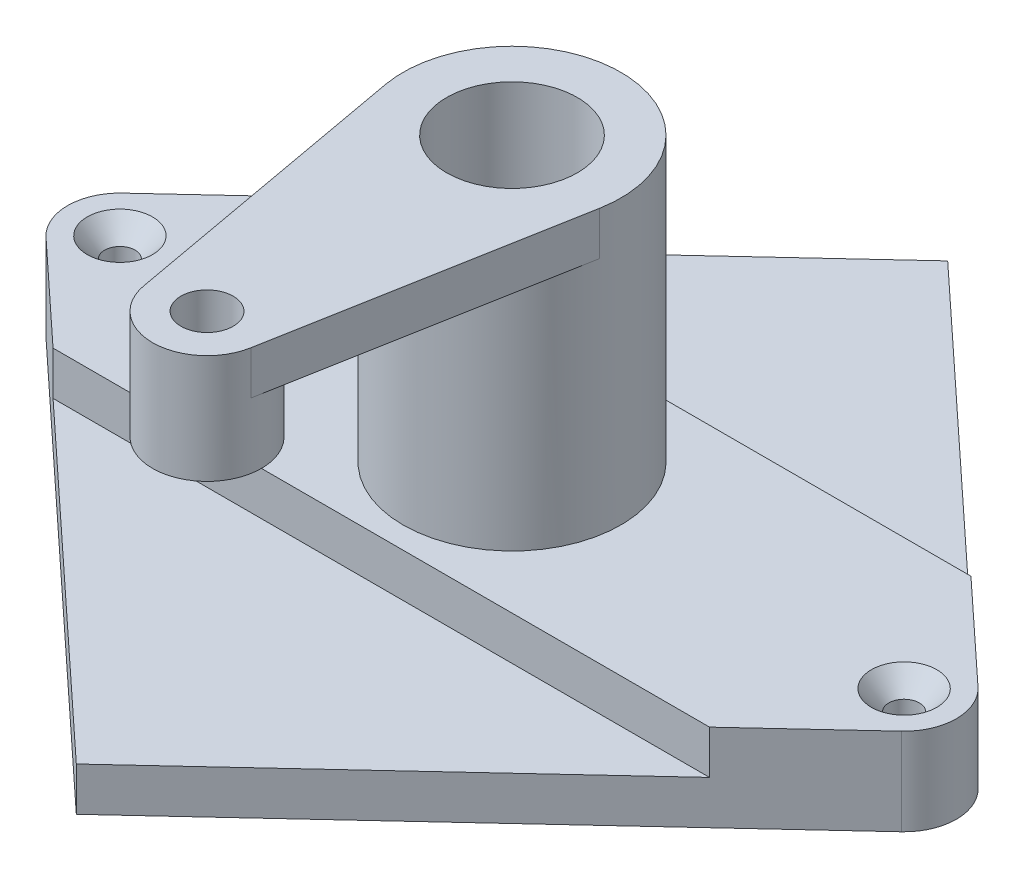
ISO-10303-21;
HEADER;
FILE_DESCRIPTION(('STEP AP214'),'2;1');
FILE_NAME('part.step','',(''),(''),'','','');
FILE_SCHEMA(('AUTOMOTIVE_DESIGN { 1 0 10303 214 1 1 1 1 }'));
ENDSEC;
DATA;
#1=APPLICATION_CONTEXT('core data for automotive mechanical design processes');
#2=APPLICATION_PROTOCOL_DEFINITION('international standard','automotive_design',2000,#1);
#3=PRODUCT_CONTEXT('',#1,'mechanical');
#4=PRODUCT('Part','Part','',(#3));
#5=PRODUCT_RELATED_PRODUCT_CATEGORY('part','',(#4));
#6=PRODUCT_DEFINITION_FORMATION('','',#4);
#7=PRODUCT_DEFINITION_CONTEXT('part definition',#1,'design');
#8=PRODUCT_DEFINITION('design','',#6,#7);
#9=PRODUCT_DEFINITION_SHAPE('','',#8);
#10=(LENGTH_UNIT() NAMED_UNIT(*) SI_UNIT(.MILLI.,.METRE.));
#11=(NAMED_UNIT(*) PLANE_ANGLE_UNIT() SI_UNIT($,.RADIAN.));
#12=(NAMED_UNIT(*) SI_UNIT($,.STERADIAN.) SOLID_ANGLE_UNIT());
#13=UNCERTAINTY_MEASURE_WITH_UNIT(LENGTH_MEASURE(1.E-05),#10,'distance_accuracy_value','');
#14=(GEOMETRIC_REPRESENTATION_CONTEXT(3) GLOBAL_UNCERTAINTY_ASSIGNED_CONTEXT((#13)) GLOBAL_UNIT_ASSIGNED_CONTEXT((#10,
#11,#12)) REPRESENTATION_CONTEXT('',''));
#15=CARTESIAN_POINT('',(0.,0.,0.));
#16=DIRECTION('',(0.,0.,1.));
#17=DIRECTION('',(1.,0.,0.));
#18=AXIS2_PLACEMENT_3D('',#15,#16,#17);
#19=CARTESIAN_POINT('',(0.,0.,0.));
#20=DIRECTION('',(0.,1.,0.));
#21=DIRECTION('',(0.,0.,1.));
#22=AXIS2_PLACEMENT_3D('',#19,#20,#21);
#23=PLANE('',#22);
#24=CARTESIAN_POINT('',(900.,0.,0.));
#25=DIRECTION('',(0.,1.,0.));
#26=DIRECTION('',(0.,0.,1.));
#27=AXIS2_PLACEMENT_3D('',#24,#25,#26);
#28=CIRCLE('',#27,74.999999987);
#29=CARTESIAN_POINT('',(900.,0.,74.999999987));
#30=VERTEX_POINT('',#29);
#31=EDGE_CURVE('E215',#30,#30,#28,.T.);
#32=ORIENTED_EDGE('',*,*,#31,.F.);
#33=EDGE_LOOP('',(#32));
#34=FACE_BOUND('',#33,.T.);
#35=CARTESIAN_POINT('',(-900.,0.,0.));
#36=DIRECTION('',(0.,1.,0.));
#37=DIRECTION('',(0.,0.,1.));
#38=AXIS2_PLACEMENT_3D('',#35,#36,#37);
#39=CIRCLE('',#38,74.999999987);
#40=CARTESIAN_POINT('',(-900.,0.,74.999999987));
#41=VERTEX_POINT('',#40);
#42=EDGE_CURVE('E235',#41,#41,#39,.T.);
#43=ORIENTED_EDGE('',*,*,#42,.F.);
#44=EDGE_LOOP('',(#43));
#45=FACE_BOUND('',#44,.T.);
#46=CARTESIAN_POINT('',(0.,0.,0.));
#47=DIRECTION('',(0.,1.,0.));
#48=DIRECTION('',(0.,0.,1.));
#49=AXIS2_PLACEMENT_3D('',#46,#47,#48);
#50=CIRCLE('',#49,250.);
#51=CARTESIAN_POINT('',(0.,0.,250.));
#52=VERTEX_POINT('',#51);
#53=EDGE_CURVE('E12',#52,#52,#50,.F.);
#54=ORIENTED_EDGE('',*,*,#53,.T.);
#55=EDGE_LOOP('',(#54));
#56=FACE_BOUND('',#55,.T.);
#57=DIRECTION('',(0.732596685082874,0.,0.680662983425414));
#58=VECTOR('',#57,1.);
#59=CARTESIAN_POINT('',(-498.651445316076,0.,536.697902994414));
#60=LINE('',#59,#58);
#61=CARTESIAN_POINT('',(-981.67955801105,0.,87.9116022099449));
#62=VERTEX_POINT('',#61);
#63=CARTESIAN_POINT('',(-753.409090909091,0.,300.));
#64=VERTEX_POINT('',#63);
#65=EDGE_CURVE('E362',#62,#64,#60,.T.);
#66=ORIENTED_EDGE('',*,*,#65,.T.);
#67=DIRECTION('',(1.,0.,0.));
#68=VECTOR('',#67,1.);
#69=CARTESIAN_POINT('',(0.,0.,300.));
#70=LINE('',#69,#68);
#71=CARTESIAN_POINT('',(753.409090909091,0.,300.));
#72=VERTEX_POINT('',#71);
#73=EDGE_CURVE('E294',#64,#72,#70,.T.);
#74=ORIENTED_EDGE('',*,*,#73,.T.);
#75=DIRECTION('',(0.732596685082873,0.,-0.680662983425414));
#76=VECTOR('',#75,1.);
#77=CARTESIAN_POINT('',(498.651445316077,0.,536.697902994414));
#78=LINE('',#77,#76);
#79=CARTESIAN_POINT('',(981.67955801105,0.,87.9116022099447));
#80=VERTEX_POINT('',#79);
#81=EDGE_CURVE('E366',#72,#80,#78,.T.);
#82=ORIENTED_EDGE('',*,*,#81,.T.);
#83=CARTESIAN_POINT('',(900.,0.,0.));
#84=DIRECTION('',(0.,1.,0.));
#85=DIRECTION('',(0.,0.,1.));
#86=AXIS2_PLACEMENT_3D('',#83,#84,#85);
#87=CIRCLE('',#86,120.);
#88=CARTESIAN_POINT('',(981.67955801105,0.,-87.9116022099444));
#89=VERTEX_POINT('',#88);
#90=EDGE_CURVE('E369',#80,#89,#87,.T.);
#91=ORIENTED_EDGE('',*,*,#90,.T.);
#92=DIRECTION('',(0.732596685082872,0.,0.680662983425415));
#93=VECTOR('',#92,1.);
#94=CARTESIAN_POINT('',(498.651445316078,0.,-536.697902994414));
#95=LINE('',#94,#93);
#96=CARTESIAN_POINT('',(753.409090909091,0.,-300.));
#97=VERTEX_POINT('',#96);
#98=EDGE_CURVE('E334',#97,#89,#95,.T.);
#99=ORIENTED_EDGE('',*,*,#98,.F.);
#100=DIRECTION('',(1.,0.,0.));
#101=VECTOR('',#100,1.);
#102=CARTESIAN_POINT('',(0.,0.,-300.));
#103=LINE('',#102,#101);
#104=CARTESIAN_POINT('',(-753.409090909091,0.,-300.));
#105=VERTEX_POINT('',#104);
#106=EDGE_CURVE('E280',#105,#97,#103,.T.);
#107=ORIENTED_EDGE('',*,*,#106,.F.);
#108=DIRECTION('',(0.732596685082873,0.,-0.680662983425414));
#109=VECTOR('',#108,1.);
#110=CARTESIAN_POINT('',(-498.651445316077,0.,-536.697902994414));
#111=LINE('',#110,#109);
#112=CARTESIAN_POINT('',(-981.67955801105,0.,-87.9116022099449));
#113=VERTEX_POINT('',#112);
#114=EDGE_CURVE('E353',#113,#105,#111,.T.);
#115=ORIENTED_EDGE('',*,*,#114,.F.);
#116=CARTESIAN_POINT('',(-900.,0.,0.));
#117=DIRECTION('',(0.,1.,0.));
#118=DIRECTION('',(0.,0.,1.));
#119=AXIS2_PLACEMENT_3D('',#116,#117,#118);
#120=CIRCLE('',#119,120.);
#121=EDGE_CURVE('E357',#113,#62,#120,.T.);
#122=ORIENTED_EDGE('',*,*,#121,.T.);
#123=EDGE_LOOP('',(#66,#74,#82,#91,#99,#107,#115,#122));
#124=FACE_BOUND('',#123,.T.);
#125=ADVANCED_FACE('F98',(#34,#45,#56,#124),#23,.T.);
#126=CARTESIAN_POINT('',(-498.651445316076,-200.,536.697902994414));
#127=DIRECTION('',(-0.680662983425414,0.,0.732596685082874));
#128=DIRECTION('',(0.732596685082874,0.,0.680662983425414));
#129=AXIS2_PLACEMENT_3D('',#126,#127,#128);
#130=PLANE('',#129);
#131=DIRECTION('',(0.732596685082873,0.,0.680662983425415));
#132=VECTOR('',#131,1.);
#133=CARTESIAN_POINT('',(-498.651445316077,-100.,536.697902994414));
#134=LINE('',#133,#132);
#135=CARTESIAN_POINT('',(-753.409090909091,-100.,300.));
#136=VERTEX_POINT('',#135);
#137=CARTESIAN_POINT('',(0.,-100.,1000.));
#138=VERTEX_POINT('',#137);
#139=EDGE_CURVE('E290',#136,#138,#134,.T.);
#140=ORIENTED_EDGE('',*,*,#139,.F.);
#141=DIRECTION('',(0.,1.,0.));
#142=VECTOR('',#141,1.);
#143=CARTESIAN_POINT('',(-753.409090909091,-100.,300.));
#144=LINE('',#143,#142);
#145=EDGE_CURVE('E306',#136,#64,#144,.T.);
#146=ORIENTED_EDGE('',*,*,#145,.T.);
#147=ORIENTED_EDGE('',*,*,#65,.F.);
#148=DIRECTION('',(0.,1.,0.));
#149=VECTOR('',#148,1.);
#150=CARTESIAN_POINT('',(-981.67955801105,-200.,87.9116022099449));
#151=LINE('',#150,#149);
#152=CARTESIAN_POINT('',(-981.67955801105,-200.,87.9116022099449));
#153=VERTEX_POINT('',#152);
#154=EDGE_CURVE('E383',#153,#62,#151,.T.);
#155=ORIENTED_EDGE('',*,*,#154,.F.);
#156=DIRECTION('',(0.732596685082874,0.,0.680662983425414));
#157=VECTOR('',#156,1.);
#158=CARTESIAN_POINT('',(-498.651445316076,-200.,536.697902994414));
#159=LINE('',#158,#157);
#160=CARTESIAN_POINT('',(0.,-200.,1000.));
#161=VERTEX_POINT('',#160);
#162=EDGE_CURVE('E338',#153,#161,#159,.T.);
#163=ORIENTED_EDGE('',*,*,#162,.T.);
#164=DIRECTION('',(0.,1.,0.));
#165=VECTOR('',#164,1.);
#166=CARTESIAN_POINT('',(0.,-200.,1000.));
#167=LINE('',#166,#165);
#168=EDGE_CURVE('E358',#161,#138,#167,.T.);
#169=ORIENTED_EDGE('',*,*,#168,.T.);
#170=EDGE_LOOP('',(#140,#146,#147,#155,#163,#169));
#171=FACE_BOUND('',#170,.T.);
#172=ADVANCED_FACE('F422',(#171),#130,.T.);
#173=CARTESIAN_POINT('',(498.651445316077,-200.,536.697902994414));
#174=DIRECTION('',(0.680662983425414,0.,0.732596685082873));
#175=DIRECTION('',(0.732596685082873,0.,-0.680662983425414));
#176=AXIS2_PLACEMENT_3D('',#173,#174,#175);
#177=PLANE('',#176);
#178=ORIENTED_EDGE('',*,*,#81,.F.);
#179=DIRECTION('',(0.,1.,0.));
#180=VECTOR('',#179,1.);
#181=CARTESIAN_POINT('',(753.409090909091,-100.,300.));
#182=LINE('',#181,#180);
#183=CARTESIAN_POINT('',(753.409090909091,-100.,300.));
#184=VERTEX_POINT('',#183);
#185=EDGE_CURVE('E301',#184,#72,#182,.T.);
#186=ORIENTED_EDGE('',*,*,#185,.F.);
#187=DIRECTION('',(0.732596685082873,0.,-0.680662983425415));
#188=VECTOR('',#187,1.);
#189=CARTESIAN_POINT('',(498.651445316077,-100.,536.697902994414));
#190=LINE('',#189,#188);
#191=EDGE_CURVE('E293',#138,#184,#190,.T.);
#192=ORIENTED_EDGE('',*,*,#191,.F.);
#193=ORIENTED_EDGE('',*,*,#168,.F.);
#194=DIRECTION('',(0.732596685082873,0.,-0.680662983425414));
#195=VECTOR('',#194,1.);
#196=CARTESIAN_POINT('',(498.651445316077,-200.,536.697902994414));
#197=LINE('',#196,#195);
#198=CARTESIAN_POINT('',(981.67955801105,-200.,87.9116022099447));
#199=VERTEX_POINT('',#198);
#200=EDGE_CURVE('E341',#161,#199,#197,.T.);
#201=ORIENTED_EDGE('',*,*,#200,.T.);
#202=DIRECTION('',(0.,1.,0.));
#203=VECTOR('',#202,1.);
#204=CARTESIAN_POINT('',(981.67955801105,-200.,87.9116022099447));
#205=LINE('',#204,#203);
#206=EDGE_CURVE('E379',#199,#80,#205,.T.);
#207=ORIENTED_EDGE('',*,*,#206,.T.);
#208=EDGE_LOOP('',(#178,#186,#192,#193,#201,#207));
#209=FACE_BOUND('',#208,.T.);
#210=ADVANCED_FACE('F428',(#209),#177,.T.);
#211=CARTESIAN_POINT('',(0.,-200.,0.));
#212=DIRECTION('',(0.,1.,0.));
#213=DIRECTION('',(0.,0.,1.));
#214=AXIS2_PLACEMENT_3D('',#211,#212,#213);
#215=CYLINDRICAL_SURFACE('',#214,250.);
#216=DIRECTION('',(0.,1.,0.));
#217=VECTOR('',#216,1.);
#218=CARTESIAN_POINT('',(-245.981737749213,550.,44.6428571428572));
#219=LINE('',#218,#217);
#220=CARTESIAN_POINT('',(-245.981737749213,550.,44.6428571428572));
#221=VERTEX_POINT('',#220);
#222=CARTESIAN_POINT('',(-245.981737749213,650.,44.6428571428572));
#223=VERTEX_POINT('',#222);
#224=EDGE_CURVE('E281',#221,#223,#219,.T.);
#225=ORIENTED_EDGE('',*,*,#224,.T.);
#226=CARTESIAN_POINT('',(0.,650.,0.));
#227=DIRECTION('',(0.,1.,0.));
#228=DIRECTION('',(0.,0.,1.));
#229=AXIS2_PLACEMENT_3D('',#226,#227,#228);
#230=CIRCLE('',#229,250.);
#231=CARTESIAN_POINT('',(245.981737749213,650.,44.6428571428572));
#232=VERTEX_POINT('',#231);
#233=EDGE_CURVE('E107',#232,#223,#230,.T.);
#234=ORIENTED_EDGE('',*,*,#233,.F.);
#235=DIRECTION('',(0.,1.,0.));
#236=VECTOR('',#235,1.);
#237=CARTESIAN_POINT('',(245.981737749213,550.,44.6428571428573));
#238=LINE('',#237,#236);
#239=CARTESIAN_POINT('',(245.981737749213,550.,44.6428571428573));
#240=VERTEX_POINT('',#239);
#241=EDGE_CURVE('E285',#240,#232,#238,.T.);
#242=ORIENTED_EDGE('',*,*,#241,.F.);
#243=CARTESIAN_POINT('',(0.,550.,0.));
#244=DIRECTION('',(0.,1.,0.));
#245=DIRECTION('',(0.,0.,1.));
#246=AXIS2_PLACEMENT_3D('',#243,#244,#245);
#247=CIRCLE('',#246,250.);
#248=EDGE_CURVE('E263',#221,#240,#247,.T.);
#249=ORIENTED_EDGE('',*,*,#248,.F.);
#250=EDGE_LOOP('',(#225,#234,#242,#249));
#251=FACE_BOUND('',#250,.T.);
#252=ORIENTED_EDGE('',*,*,#53,.F.);
#253=EDGE_LOOP('',(#252));
#254=FACE_BOUND('',#253,.T.);
#255=ADVANCED_FACE('F100',(#251,#254),#215,.T.);
#256=CARTESIAN_POINT('',(0.,650.,0.));
#257=DIRECTION('',(0.,1.,0.));
#258=DIRECTION('',(0.,0.,1.));
#259=AXIS2_PLACEMENT_3D('',#256,#257,#258);
#260=PLANE('',#259);
#261=CARTESIAN_POINT('',(0.,650.,700.));
#262=DIRECTION('',(0.,1.,0.));
#263=DIRECTION('',(0.,0.,1.));
#264=AXIS2_PLACEMENT_3D('',#261,#262,#263);
#265=CIRCLE('',#264,60.);
#266=CARTESIAN_POINT('',(0.,650.,760.));
#267=VERTEX_POINT('',#266);
#268=EDGE_CURVE('E805',#267,#267,#265,.T.);
#269=ORIENTED_EDGE('',*,*,#268,.F.);
#270=EDGE_LOOP('',(#269));
#271=FACE_BOUND('',#270,.T.);
#272=CARTESIAN_POINT('',(0.,650.,0.));
#273=DIRECTION('',(0.,1.,0.));
#274=DIRECTION('',(0.,0.,1.));
#275=AXIS2_PLACEMENT_3D('',#272,#273,#274);
#276=CIRCLE('',#275,149.999999974);
#277=CARTESIAN_POINT('',(0.,650.,149.999999974));
#278=VERTEX_POINT('',#277);
#279=EDGE_CURVE('E809',#278,#278,#276,.T.);
#280=ORIENTED_EDGE('',*,*,#279,.F.);
#281=EDGE_LOOP('',(#280));
#282=FACE_BOUND('',#281,.T.);
#283=ORIENTED_EDGE('',*,*,#233,.T.);
#284=DIRECTION('',(0.178571428571429,0.,0.983926950996851));
#285=VECTOR('',#284,1.);
#286=CARTESIAN_POINT('',(-245.981737749213,650.,44.6428571428571));
#287=LINE('',#286,#285);
#288=CARTESIAN_POINT('',(-122.990868874606,650.,722.321428571429));
#289=VERTEX_POINT('',#288);
#290=EDGE_CURVE('E259',#223,#289,#287,.T.);
#291=ORIENTED_EDGE('',*,*,#290,.T.);
#292=CARTESIAN_POINT('',(0.,650.,700.));
#293=DIRECTION('',(0.,1.,0.));
#294=DIRECTION('',(0.,0.,1.));
#295=AXIS2_PLACEMENT_3D('',#292,#293,#294);
#296=CIRCLE('',#295,125.);
#297=CARTESIAN_POINT('',(122.990868874606,650.,722.321428571429));
#298=VERTEX_POINT('',#297);
#299=EDGE_CURVE('E247',#289,#298,#296,.T.);
#300=ORIENTED_EDGE('',*,*,#299,.T.);
#301=DIRECTION('',(-0.178571428571429,0.,0.983926950996851));
#302=VECTOR('',#301,1.);
#303=CARTESIAN_POINT('',(245.981737749213,650.,44.6428571428572));
#304=LINE('',#303,#302);
#305=EDGE_CURVE('E114',#232,#298,#304,.T.);
#306=ORIENTED_EDGE('',*,*,#305,.F.);
#307=EDGE_LOOP('',(#283,#291,#300,#306));
#308=FACE_BOUND('',#307,.T.);
#309=ADVANCED_FACE('F395',(#271,#282,#308),#260,.T.);
#310=CARTESIAN_POINT('',(900.,-200.,0.));
#311=DIRECTION('',(0.,1.,0.));
#312=DIRECTION('',(0.,0.,1.));
#313=AXIS2_PLACEMENT_3D('',#310,#311,#312);
#314=CYLINDRICAL_SURFACE('',#313,120.);
#315=ORIENTED_EDGE('',*,*,#90,.F.);
#316=ORIENTED_EDGE('',*,*,#206,.F.);
#317=CARTESIAN_POINT('',(900.,-200.,0.));
#318=DIRECTION('',(0.,1.,0.));
#319=DIRECTION('',(0.,0.,1.));
#320=AXIS2_PLACEMENT_3D('',#317,#318,#319);
#321=CIRCLE('',#320,120.);
#322=CARTESIAN_POINT('',(981.67955801105,-200.,-87.9116022099444));
#323=VERTEX_POINT('',#322);
#324=EDGE_CURVE('E345',#199,#323,#321,.T.);
#325=ORIENTED_EDGE('',*,*,#324,.T.);
#326=DIRECTION('',(0.,1.,0.));
#327=VECTOR('',#326,1.);
#328=CARTESIAN_POINT('',(981.67955801105,-200.,-87.9116022099444));
#329=LINE('',#328,#327);
#330=EDGE_CURVE('E375',#323,#89,#329,.T.);
#331=ORIENTED_EDGE('',*,*,#330,.T.);
#332=EDGE_LOOP('',(#315,#316,#325,#331));
#333=FACE_BOUND('',#332,.T.);
#334=ADVANCED_FACE('F441',(#333),#314,.T.);
#335=CARTESIAN_POINT('',(498.651445316078,-200.,-536.697902994414));
#336=DIRECTION('',(-0.680662983425415,0.,0.732596685082872));
#337=DIRECTION('',(0.732596685082872,0.,0.680662983425415));
#338=AXIS2_PLACEMENT_3D('',#335,#336,#337);
#339=PLANE('',#338);
#340=DIRECTION('',(-0.732596685082873,0.,-0.680662983425414));
#341=VECTOR('',#340,1.);
#342=CARTESIAN_POINT('',(498.651445316077,-100.,-536.697902994414));
#343=LINE('',#342,#341);
#344=CARTESIAN_POINT('',(753.409090909091,-100.,-300.));
#345=VERTEX_POINT('',#344);
#346=CARTESIAN_POINT('',(0.,-100.,-1000.));
#347=VERTEX_POINT('',#346);
#348=EDGE_CURVE('E122',#345,#347,#343,.T.);
#349=ORIENTED_EDGE('',*,*,#348,.F.);
#350=DIRECTION('',(0.,1.,0.));
#351=VECTOR('',#350,1.);
#352=CARTESIAN_POINT('',(753.409090909091,-100.,-300.));
#353=LINE('',#352,#351);
#354=EDGE_CURVE('E305',#345,#97,#353,.T.);
#355=ORIENTED_EDGE('',*,*,#354,.T.);
#356=ORIENTED_EDGE('',*,*,#98,.T.);
#357=ORIENTED_EDGE('',*,*,#330,.F.);
#358=DIRECTION('',(0.732596685082872,0.,0.680662983425415));
#359=VECTOR('',#358,1.);
#360=CARTESIAN_POINT('',(498.651445316078,-200.,-536.697902994414));
#361=LINE('',#360,#359);
#362=CARTESIAN_POINT('',(0.,-200.,-1000.));
#363=VERTEX_POINT('',#362);
#364=EDGE_CURVE('E349',#363,#323,#361,.T.);
#365=ORIENTED_EDGE('',*,*,#364,.F.);
#366=DIRECTION('',(0.,1.,0.));
#367=VECTOR('',#366,1.);
#368=CARTESIAN_POINT('',(0.,-200.,-1000.));
#369=LINE('',#368,#367);
#370=EDGE_CURVE('E310',#363,#347,#369,.T.);
#371=ORIENTED_EDGE('',*,*,#370,.T.);
#372=EDGE_LOOP('',(#349,#355,#356,#357,#365,#371));
#373=FACE_BOUND('',#372,.T.);
#374=ADVANCED_FACE('F437',(#373),#339,.F.);
#375=CARTESIAN_POINT('',(-498.651445316077,-200.,-536.697902994414));
#376=DIRECTION('',(0.680662983425414,0.,0.732596685082873));
#377=DIRECTION('',(0.732596685082873,0.,-0.680662983425414));
#378=AXIS2_PLACEMENT_3D('',#375,#376,#377);
#379=PLANE('',#378);
#380=ORIENTED_EDGE('',*,*,#114,.T.);
#381=DIRECTION('',(0.,1.,0.));
#382=VECTOR('',#381,1.);
#383=CARTESIAN_POINT('',(-753.409090909091,-100.,-300.));
#384=LINE('',#383,#382);
#385=CARTESIAN_POINT('',(-753.409090909091,-100.,-300.));
#386=VERTEX_POINT('',#385);
#387=EDGE_CURVE('E321',#386,#105,#384,.T.);
#388=ORIENTED_EDGE('',*,*,#387,.F.);
#389=DIRECTION('',(-0.732596685082873,0.,0.680662983425415));
#390=VECTOR('',#389,1.);
#391=CARTESIAN_POINT('',(-498.651445316077,-100.,-536.697902994414));
#392=LINE('',#391,#390);
#393=EDGE_CURVE('E315',#347,#386,#392,.T.);
#394=ORIENTED_EDGE('',*,*,#393,.F.);
#395=ORIENTED_EDGE('',*,*,#370,.F.);
#396=DIRECTION('',(0.732596685082873,0.,-0.680662983425414));
#397=VECTOR('',#396,1.);
#398=CARTESIAN_POINT('',(-498.651445316077,-200.,-536.697902994414));
#399=LINE('',#398,#397);
#400=CARTESIAN_POINT('',(-981.67955801105,-200.,-87.9116022099449));
#401=VERTEX_POINT('',#400);
#402=EDGE_CURVE('E329',#401,#363,#399,.T.);
#403=ORIENTED_EDGE('',*,*,#402,.F.);
#404=DIRECTION('',(0.,1.,0.));
#405=VECTOR('',#404,1.);
#406=CARTESIAN_POINT('',(-981.67955801105,-200.,-87.9116022099449));
#407=LINE('',#406,#405);
#408=EDGE_CURVE('E352',#401,#113,#407,.T.);
#409=ORIENTED_EDGE('',*,*,#408,.T.);
#410=EDGE_LOOP('',(#380,#388,#394,#395,#403,#409));
#411=FACE_BOUND('',#410,.T.);
#412=ADVANCED_FACE('F440',(#411),#379,.F.);
#413=CARTESIAN_POINT('',(-900.,-200.,0.));
#414=DIRECTION('',(0.,1.,0.));
#415=DIRECTION('',(0.,0.,1.));
#416=AXIS2_PLACEMENT_3D('',#413,#414,#415);
#417=CYLINDRICAL_SURFACE('',#416,120.);
#418=ORIENTED_EDGE('',*,*,#121,.F.);
#419=ORIENTED_EDGE('',*,*,#408,.F.);
#420=CARTESIAN_POINT('',(-900.,-200.,0.));
#421=DIRECTION('',(0.,1.,0.));
#422=DIRECTION('',(0.,0.,1.));
#423=AXIS2_PLACEMENT_3D('',#420,#421,#422);
#424=CIRCLE('',#423,120.);
#425=EDGE_CURVE('E333',#401,#153,#424,.T.);
#426=ORIENTED_EDGE('',*,*,#425,.T.);
#427=ORIENTED_EDGE('',*,*,#154,.T.);
#428=EDGE_LOOP('',(#418,#419,#426,#427));
#429=FACE_BOUND('',#428,.T.);
#430=ADVANCED_FACE('F449',(#429),#417,.T.);
#431=CARTESIAN_POINT('',(0.,-200.,0.));
#432=DIRECTION('',(0.,1.,0.));
#433=DIRECTION('',(0.,0.,1.));
#434=AXIS2_PLACEMENT_3D('',#431,#432,#433);
#435=PLANE('',#434);
#436=CARTESIAN_POINT('',(900.,-200.,0.));
#437=DIRECTION('',(0.,1.,0.));
#438=DIRECTION('',(0.,0.,1.));
#439=AXIS2_PLACEMENT_3D('',#436,#437,#438);
#440=CIRCLE('',#439,34.9999999769999);
#441=CARTESIAN_POINT('',(900.,-200.,34.9999999769999));
#442=VERTEX_POINT('',#441);
#443=EDGE_CURVE('E231',#442,#442,#440,.T.);
#444=ORIENTED_EDGE('',*,*,#443,.T.);
#445=EDGE_LOOP('',(#444));
#446=FACE_BOUND('',#445,.T.);
#447=CARTESIAN_POINT('',(-900.,-200.,0.));
#448=DIRECTION('',(0.,1.,0.));
#449=DIRECTION('',(0.,0.,1.));
#450=AXIS2_PLACEMENT_3D('',#447,#448,#449);
#451=CIRCLE('',#450,34.9999999769999);
#452=CARTESIAN_POINT('',(-900.,-200.,34.9999999769999));
#453=VERTEX_POINT('',#452);
#454=EDGE_CURVE('E243',#453,#453,#451,.T.);
#455=ORIENTED_EDGE('',*,*,#454,.T.);
#456=EDGE_LOOP('',(#455));
#457=FACE_BOUND('',#456,.T.);
#458=ORIENTED_EDGE('',*,*,#402,.T.);
#459=ORIENTED_EDGE('',*,*,#364,.T.);
#460=ORIENTED_EDGE('',*,*,#324,.F.);
#461=ORIENTED_EDGE('',*,*,#200,.F.);
#462=ORIENTED_EDGE('',*,*,#162,.F.);
#463=ORIENTED_EDGE('',*,*,#425,.F.);
#464=EDGE_LOOP('',(#458,#459,#460,#461,#462,#463));
#465=FACE_BOUND('',#464,.T.);
#466=ADVANCED_FACE('F452',(#446,#457,#465),#435,.F.);
#467=CARTESIAN_POINT('',(0.,-100.,300.));
#468=DIRECTION('',(0.,0.,1.));
#469=DIRECTION('',(1.,0.,0.));
#470=AXIS2_PLACEMENT_3D('',#467,#468,#469);
#471=PLANE('',#470);
#472=ORIENTED_EDGE('',*,*,#73,.F.);
#473=ORIENTED_EDGE('',*,*,#145,.F.);
#474=DIRECTION('',(1.,0.,0.));
#475=VECTOR('',#474,1.);
#476=CARTESIAN_POINT('',(0.,-100.,300.));
#477=LINE('',#476,#475);
#478=EDGE_CURVE('E298',#136,#184,#477,.T.);
#479=ORIENTED_EDGE('',*,*,#478,.T.);
#480=ORIENTED_EDGE('',*,*,#185,.T.);
#481=EDGE_LOOP('',(#472,#473,#479,#480));
#482=FACE_BOUND('',#481,.T.);
#483=ADVANCED_FACE('F460',(#482),#471,.T.);
#484=CARTESIAN_POINT('',(0.,-100.,0.));
#485=DIRECTION('',(0.,1.,0.));
#486=DIRECTION('',(0.,0.,1.));
#487=AXIS2_PLACEMENT_3D('',#484,#485,#486);
#488=PLANE('',#487);
#489=ORIENTED_EDGE('',*,*,#139,.T.);
#490=ORIENTED_EDGE('',*,*,#191,.T.);
#491=ORIENTED_EDGE('',*,*,#478,.F.);
#492=EDGE_LOOP('',(#489,#490,#491));
#493=FACE_BOUND('',#492,.T.);
#494=ADVANCED_FACE('F465',(#493),#488,.T.);
#495=CARTESIAN_POINT('',(0.,-100.,-300.));
#496=DIRECTION('',(0.,0.,1.));
#497=DIRECTION('',(1.,0.,0.));
#498=AXIS2_PLACEMENT_3D('',#495,#496,#497);
#499=PLANE('',#498);
#500=ORIENTED_EDGE('',*,*,#106,.T.);
#501=ORIENTED_EDGE('',*,*,#354,.F.);
#502=DIRECTION('',(1.,0.,0.));
#503=VECTOR('',#502,1.);
#504=CARTESIAN_POINT('',(0.,-100.,-300.));
#505=LINE('',#504,#503);
#506=EDGE_CURVE('E318',#386,#345,#505,.T.);
#507=ORIENTED_EDGE('',*,*,#506,.F.);
#508=ORIENTED_EDGE('',*,*,#387,.T.);
#509=EDGE_LOOP('',(#500,#501,#507,#508));
#510=FACE_BOUND('',#509,.T.);
#511=ADVANCED_FACE('F435',(#510),#499,.F.);
#512=CARTESIAN_POINT('',(0.,-100.,0.));
#513=DIRECTION('',(0.,1.,0.));
#514=DIRECTION('',(0.,0.,1.));
#515=AXIS2_PLACEMENT_3D('',#512,#513,#514);
#516=PLANE('',#515);
#517=ORIENTED_EDGE('',*,*,#348,.T.);
#518=ORIENTED_EDGE('',*,*,#393,.T.);
#519=ORIENTED_EDGE('',*,*,#506,.T.);
#520=EDGE_LOOP('',(#517,#518,#519));
#521=FACE_BOUND('',#520,.T.);
#522=ADVANCED_FACE('F418',(#521),#516,.T.);
#523=CARTESIAN_POINT('',(-245.981737749213,550.,44.6428571428571));
#524=DIRECTION('',(-0.983926950996851,0.,0.178571428571429));
#525=DIRECTION('',(0.178571428571429,0.,0.983926950996851));
#526=AXIS2_PLACEMENT_3D('',#523,#524,#525);
#527=PLANE('',#526);
#528=ORIENTED_EDGE('',*,*,#290,.F.);
#529=ORIENTED_EDGE('',*,*,#224,.F.);
#530=DIRECTION('',(0.178571428571429,0.,0.983926950996851));
#531=VECTOR('',#530,1.);
#532=CARTESIAN_POINT('',(-245.981737749213,550.,44.6428571428571));
#533=LINE('',#532,#531);
#534=CARTESIAN_POINT('',(-122.990868874606,550.,722.321428571429));
#535=VERTEX_POINT('',#534);
#536=EDGE_CURVE('E266',#221,#535,#533,.T.);
#537=ORIENTED_EDGE('',*,*,#536,.T.);
#538=DIRECTION('',(0.,1.,0.));
#539=VECTOR('',#538,1.);
#540=CARTESIAN_POINT('',(-122.990868874606,550.,722.321428571429));
#541=LINE('',#540,#539);
#542=EDGE_CURVE('E276',#535,#289,#541,.T.);
#543=ORIENTED_EDGE('',*,*,#542,.T.);
#544=EDGE_LOOP('',(#528,#529,#537,#543));
#545=FACE_BOUND('',#544,.T.);
#546=ADVANCED_FACE('F402',(#545),#527,.T.);
#547=CARTESIAN_POINT('',(245.981737749213,550.,44.6428571428572));
#548=DIRECTION('',(-0.983926950996851,0.,-0.178571428571429));
#549=DIRECTION('',(-0.178571428571429,0.,0.983926950996851));
#550=AXIS2_PLACEMENT_3D('',#547,#548,#549);
#551=PLANE('',#550);
#552=ORIENTED_EDGE('',*,*,#305,.T.);
#553=DIRECTION('',(0.,1.,0.));
#554=VECTOR('',#553,1.);
#555=CARTESIAN_POINT('',(122.990868874606,550.,722.321428571429));
#556=LINE('',#555,#554);
#557=CARTESIAN_POINT('',(122.990868874606,550.,722.321428571429));
#558=VERTEX_POINT('',#557);
#559=EDGE_CURVE('E270',#558,#298,#556,.T.);
#560=ORIENTED_EDGE('',*,*,#559,.F.);
#561=DIRECTION('',(-0.178571428571429,0.,0.983926950996851));
#562=VECTOR('',#561,1.);
#563=CARTESIAN_POINT('',(245.981737749213,550.,44.6428571428572));
#564=LINE('',#563,#562);
#565=EDGE_CURVE('E258',#240,#558,#564,.T.);
#566=ORIENTED_EDGE('',*,*,#565,.F.);
#567=ORIENTED_EDGE('',*,*,#241,.T.);
#568=EDGE_LOOP('',(#552,#560,#566,#567));
#569=FACE_BOUND('',#568,.T.);
#570=ADVANCED_FACE('F410',(#569),#551,.F.);
#571=CARTESIAN_POINT('',(0.,550.,0.));
#572=DIRECTION('',(0.,1.,0.));
#573=DIRECTION('',(0.,0.,1.));
#574=AXIS2_PLACEMENT_3D('',#571,#572,#573);
#575=PLANE('',#574);
#576=CARTESIAN_POINT('',(0.,550.,700.));
#577=DIRECTION('',(0.,1.,0.));
#578=DIRECTION('',(0.,0.,1.));
#579=AXIS2_PLACEMENT_3D('',#576,#577,#578);
#580=CIRCLE('',#579,125.);
#581=EDGE_CURVE('E254',#558,#535,#580,.T.);
#582=ORIENTED_EDGE('',*,*,#581,.T.);
#583=ORIENTED_EDGE('',*,*,#536,.F.);
#584=ORIENTED_EDGE('',*,*,#248,.T.);
#585=ORIENTED_EDGE('',*,*,#565,.T.);
#586=EDGE_LOOP('',(#582,#583,#584,#585));
#587=FACE_BOUND('',#586,.T.);
#588=ADVANCED_FACE('F404',(#587),#575,.F.);
#589=CARTESIAN_POINT('',(0.,400.,700.));
#590=DIRECTION('',(0.,1.,0.));
#591=DIRECTION('',(0.,0.,1.));
#592=AXIS2_PLACEMENT_3D('',#589,#590,#591);
#593=CYLINDRICAL_SURFACE('',#592,125.);
#594=CARTESIAN_POINT('',(0.,400.,700.));
#595=DIRECTION('',(0.,1.,0.));
#596=DIRECTION('',(0.,0.,1.));
#597=AXIS2_PLACEMENT_3D('',#594,#595,#596);
#598=CIRCLE('',#597,125.);
#599=CARTESIAN_POINT('',(0.,400.,825.));
#600=VERTEX_POINT('',#599);
#601=EDGE_CURVE('E248',#600,#600,#598,.T.);
#602=ORIENTED_EDGE('',*,*,#601,.T.);
#603=EDGE_LOOP('',(#602));
#604=FACE_BOUND('',#603,.T.);
#605=ORIENTED_EDGE('',*,*,#542,.F.);
#606=ORIENTED_EDGE('',*,*,#581,.F.);
#607=ORIENTED_EDGE('',*,*,#559,.T.);
#608=ORIENTED_EDGE('',*,*,#299,.F.);
#609=EDGE_LOOP('',(#605,#606,#607,#608));
#610=FACE_BOUND('',#609,.T.);
#611=ADVANCED_FACE('F408',(#604,#610),#593,.T.);
#612=CARTESIAN_POINT('',(0.,400.,0.));
#613=DIRECTION('',(0.,1.,0.));
#614=DIRECTION('',(0.,0.,1.));
#615=AXIS2_PLACEMENT_3D('',#612,#613,#614);
#616=PLANE('',#615);
#617=CARTESIAN_POINT('',(0.,400.,700.));
#618=DIRECTION('',(0.,1.,0.));
#619=DIRECTION('',(0.,0.,1.));
#620=AXIS2_PLACEMENT_3D('',#617,#618,#619);
#621=CIRCLE('',#620,60.);
#622=CARTESIAN_POINT('',(0.,400.,760.));
#623=VERTEX_POINT('',#622);
#624=EDGE_CURVE('E802',#623,#623,#621,.T.);
#625=ORIENTED_EDGE('',*,*,#624,.T.);
#626=EDGE_LOOP('',(#625));
#627=FACE_BOUND('',#626,.T.);
#628=ORIENTED_EDGE('',*,*,#601,.F.);
#629=EDGE_LOOP('',(#628));
#630=FACE_BOUND('',#629,.T.);
#631=ADVANCED_FACE('F554',(#627,#630),#616,.F.);
#632=CARTESIAN_POINT('',(-900.,0.,0.));
#633=DIRECTION('',(0.,1.,0.));
#634=DIRECTION('',(0.,0.,1.));
#635=AXIS2_PLACEMENT_3D('',#632,#633,#634);
#636=CYLINDRICAL_SURFACE('',#635,34.9999999769999);
#637=ORIENTED_EDGE('',*,*,#454,.F.);
#638=EDGE_LOOP('',(#637));
#639=FACE_BOUND('',#638,.T.);
#640=CARTESIAN_POINT('',(-900.,-46.0147363003441,0.));
#641=DIRECTION('',(0.,1.,0.));
#642=DIRECTION('',(0.,0.,1.));
#643=AXIS2_PLACEMENT_3D('',#640,#641,#642);
#644=CIRCLE('',#643,34.9999999769999);
#645=CARTESIAN_POINT('',(-900.,-46.0147363003441,34.9999999769999));
#646=VERTEX_POINT('',#645);
#647=EDGE_CURVE('E239',#646,#646,#644,.T.);
#648=ORIENTED_EDGE('',*,*,#647,.T.);
#649=EDGE_LOOP('',(#648));
#650=FACE_BOUND('',#649,.T.);
#651=ADVANCED_FACE('F576',(#639,#650),#636,.F.);
#652=CARTESIAN_POINT('',(-900.,0.,0.));
#653=DIRECTION('',(0.,1.,0.));
#654=DIRECTION('',(0.,0.,1.));
#655=AXIS2_PLACEMENT_3D('',#652,#653,#654);
#656=CONICAL_SURFACE('',#655,74.999999987,0.715584993317676);
#657=ORIENTED_EDGE('',*,*,#647,.F.);
#658=EDGE_LOOP('',(#657));
#659=FACE_BOUND('',#658,.T.);
#660=ORIENTED_EDGE('',*,*,#42,.T.);
#661=EDGE_LOOP('',(#660));
#662=FACE_BOUND('',#661,.T.);
#663=ADVANCED_FACE('F581',(#659,#662),#656,.F.);
#664=CARTESIAN_POINT('',(900.,0.,0.));
#665=DIRECTION('',(0.,1.,0.));
#666=DIRECTION('',(0.,0.,1.));
#667=AXIS2_PLACEMENT_3D('',#664,#665,#666);
#668=CYLINDRICAL_SURFACE('',#667,34.9999999769999);
#669=ORIENTED_EDGE('',*,*,#443,.F.);
#670=EDGE_LOOP('',(#669));
#671=FACE_BOUND('',#670,.T.);
#672=CARTESIAN_POINT('',(900.,-46.0147363003441,0.));
#673=DIRECTION('',(0.,1.,0.));
#674=DIRECTION('',(0.,0.,1.));
#675=AXIS2_PLACEMENT_3D('',#672,#673,#674);
#676=CIRCLE('',#675,34.9999999769999);
#677=CARTESIAN_POINT('',(900.,-46.0147363003441,34.9999999769999));
#678=VERTEX_POINT('',#677);
#679=EDGE_CURVE('E221',#678,#678,#676,.T.);
#680=ORIENTED_EDGE('',*,*,#679,.T.);
#681=EDGE_LOOP('',(#680));
#682=FACE_BOUND('',#681,.T.);
#683=ADVANCED_FACE('F592',(#671,#682),#668,.F.);
#684=CARTESIAN_POINT('',(900.,0.,0.));
#685=DIRECTION('',(0.,1.,0.));
#686=DIRECTION('',(0.,0.,1.));
#687=AXIS2_PLACEMENT_3D('',#684,#685,#686);
#688=CONICAL_SURFACE('',#687,74.999999987,0.715584993317676);
#689=ORIENTED_EDGE('',*,*,#679,.F.);
#690=EDGE_LOOP('',(#689));
#691=FACE_BOUND('',#690,.T.);
#692=ORIENTED_EDGE('',*,*,#31,.T.);
#693=EDGE_LOOP('',(#692));
#694=FACE_BOUND('',#693,.T.);
#695=ADVANCED_FACE('F208',(#691,#694),#688,.F.);
#696=CARTESIAN_POINT('',(0.,224.034424767111,0.));
#697=DIRECTION('',(0.,1.,0.));
#698=DIRECTION('',(0.,0.,1.));
#699=AXIS2_PLACEMENT_3D('',#696,#697,#698);
#700=CONICAL_SURFACE('',#699,40.0000000099999,1.02974425867665);
#701=CARTESIAN_POINT('',(-1.11022302462516E-13,200.,0.));
#702=VERTEX_POINT('',#701);
#703=VERTEX_LOOP('',#702);
#704=FACE_BOUND('',#703,.T.);
#705=CARTESIAN_POINT('',(0.,224.034424767111,0.));
#706=DIRECTION('',(0.,1.,0.));
#707=DIRECTION('',(0.,0.,1.));
#708=AXIS2_PLACEMENT_3D('',#705,#706,#707);
#709=CIRCLE('',#708,40.0000000099999);
#710=CARTESIAN_POINT('',(0.,224.034424767111,40.0000000099999));
#711=VERTEX_POINT('',#710);
#712=EDGE_CURVE('E212',#711,#711,#709,.T.);
#713=ORIENTED_EDGE('',*,*,#712,.T.);
#714=EDGE_LOOP('',(#713));
#715=FACE_BOUND('',#714,.T.);
#716=ADVANCED_FACE('F204',(#704,#715),#700,.F.);
#717=CARTESIAN_POINT('',(0.,650.,0.));
#718=DIRECTION('',(0.,1.,0.));
#719=DIRECTION('',(0.,0.,1.));
#720=AXIS2_PLACEMENT_3D('',#717,#718,#719);
#721=CYLINDRICAL_SURFACE('',#720,40.0000000099999);
#722=ORIENTED_EDGE('',*,*,#712,.F.);
#723=EDGE_LOOP('',(#722));
#724=FACE_BOUND('',#723,.T.);
#725=CARTESIAN_POINT('',(0.,299.999999976,0.));
#726=DIRECTION('',(0.,1.,0.));
#727=DIRECTION('',(0.,0.,1.));
#728=AXIS2_PLACEMENT_3D('',#725,#726,#727);
#729=CIRCLE('',#728,40.0000000099999);
#730=CARTESIAN_POINT('',(0.,299.999999976,40.0000000099999));
#731=VERTEX_POINT('',#730);
#732=EDGE_CURVE('E216',#731,#731,#729,.T.);
#733=ORIENTED_EDGE('',*,*,#732,.T.);
#734=EDGE_LOOP('',(#733));
#735=FACE_BOUND('',#734,.T.);
#736=ADVANCED_FACE('F207',(#724,#735),#721,.F.);
#737=CARTESIAN_POINT('',(40.0000000099999,299.999999976,0.));
#738=DIRECTION('',(0.,-1.,0.));
#739=DIRECTION('',(0.,0.,-1.));
#740=AXIS2_PLACEMENT_3D('',#737,#738,#739);
#741=PLANE('',#740);
#742=ORIENTED_EDGE('',*,*,#732,.F.);
#743=EDGE_LOOP('',(#742));
#744=FACE_BOUND('',#743,.T.);
#745=CARTESIAN_POINT('',(0.,299.999999976,0.));
#746=DIRECTION('',(0.,1.,0.));
#747=DIRECTION('',(0.,0.,1.));
#748=AXIS2_PLACEMENT_3D('',#745,#746,#747);
#749=CIRCLE('',#748,149.999999974);
#750=CARTESIAN_POINT('',(0.,299.999999976,149.999999974));
#751=VERTEX_POINT('',#750);
#752=EDGE_CURVE('E224',#751,#751,#749,.T.);
#753=ORIENTED_EDGE('',*,*,#752,.T.);
#754=EDGE_LOOP('',(#753));
#755=FACE_BOUND('',#754,.T.);
#756=ADVANCED_FACE('F630',(#744,#755),#741,.F.);
#757=CARTESIAN_POINT('',(0.,650.,0.));
#758=DIRECTION('',(0.,1.,0.));
#759=DIRECTION('',(0.,0.,1.));
#760=AXIS2_PLACEMENT_3D('',#757,#758,#759);
#761=CYLINDRICAL_SURFACE('',#760,149.999999974);
#762=ORIENTED_EDGE('',*,*,#752,.F.);
#763=EDGE_LOOP('',(#762));
#764=FACE_BOUND('',#763,.T.);
#765=ORIENTED_EDGE('',*,*,#279,.T.);
#766=EDGE_LOOP('',(#765));
#767=FACE_BOUND('',#766,.T.);
#768=ADVANCED_FACE('F640',(#764,#767),#761,.F.);
#769=CARTESIAN_POINT('',(0.,650.,700.));
#770=DIRECTION('',(0.,1.,0.));
#771=DIRECTION('',(0.,0.,1.));
#772=AXIS2_PLACEMENT_3D('',#769,#770,#771);
#773=CYLINDRICAL_SURFACE('',#772,60.);
#774=ORIENTED_EDGE('',*,*,#624,.F.);
#775=EDGE_LOOP('',(#774));
#776=FACE_BOUND('',#775,.T.);
#777=ORIENTED_EDGE('',*,*,#268,.T.);
#778=EDGE_LOOP('',(#777));
#779=FACE_BOUND('',#778,.T.);
#780=ADVANCED_FACE('F650',(#776,#779),#773,.F.);
#781=CLOSED_SHELL('',(#125,#172,#210,#255,#309,#334,#374,#412,#430,#466,#483,#494,#511,#522,
#546,#570,#588,#611,#631,#651,#663,#683,#695,#716,#736,#756,#768,#780));
#782=MANIFOLD_SOLID_BREP('B2',#781);
#783=ADVANCED_BREP_SHAPE_REPRESENTATION('',(#18,#782),#14);
#784=SHAPE_DEFINITION_REPRESENTATION(#9,#783);
ENDSEC;
END-ISO-10303-21;
